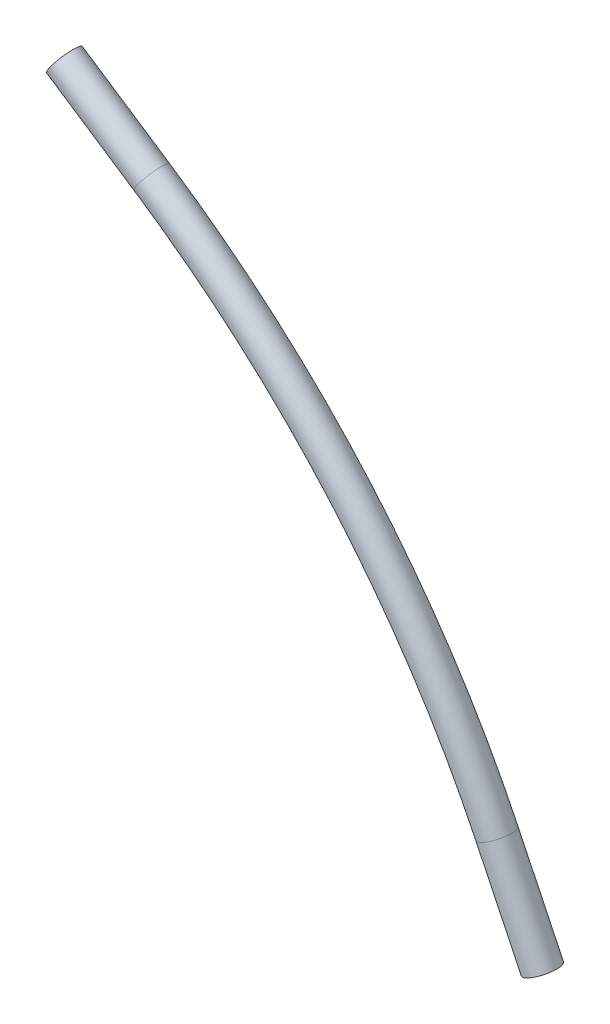
ISO-10303-21;
HEADER;
FILE_DESCRIPTION(('STEP AP214'),'2;1');
FILE_NAME('part.step','',(''),(''),'','','');
FILE_SCHEMA(('AUTOMOTIVE_DESIGN { 1 0 10303 214 1 1 1 1 }'));
ENDSEC;
DATA;
#1=APPLICATION_CONTEXT('core data for automotive mechanical design processes');
#2=APPLICATION_PROTOCOL_DEFINITION('international standard','automotive_design',2000,#1);
#3=PRODUCT_CONTEXT('',#1,'mechanical');
#4=PRODUCT('Part','Part','',(#3));
#5=PRODUCT_RELATED_PRODUCT_CATEGORY('part','',(#4));
#6=PRODUCT_DEFINITION_FORMATION('','',#4);
#7=PRODUCT_DEFINITION_CONTEXT('part definition',#1,'design');
#8=PRODUCT_DEFINITION('design','',#6,#7);
#9=PRODUCT_DEFINITION_SHAPE('','',#8);
#10=(LENGTH_UNIT() NAMED_UNIT(*) SI_UNIT(.MILLI.,.METRE.));
#11=(NAMED_UNIT(*) PLANE_ANGLE_UNIT() SI_UNIT($,.RADIAN.));
#12=(NAMED_UNIT(*) SI_UNIT($,.STERADIAN.) SOLID_ANGLE_UNIT());
#13=UNCERTAINTY_MEASURE_WITH_UNIT(LENGTH_MEASURE(1.E-05),#10,'distance_accuracy_value','');
#14=(GEOMETRIC_REPRESENTATION_CONTEXT(3) GLOBAL_UNCERTAINTY_ASSIGNED_CONTEXT((#13)) GLOBAL_UNIT_ASSIGNED_CONTEXT((#10,
#11,#12)) REPRESENTATION_CONTEXT('',''));
#15=CARTESIAN_POINT('',(0.,0.,0.));
#16=DIRECTION('',(0.,0.,1.));
#17=DIRECTION('',(1.,0.,0.));
#18=AXIS2_PLACEMENT_3D('',#15,#16,#17);
#19=CARTESIAN_POINT('',(45.6269356465842,141.339048086015,0.));
#20=DIRECTION('',(-0.433534068813756,0.901137176670561,0.));
#21=DIRECTION('',(-0.901137176670561,-0.433534068813756,0.));
#22=AXIS2_PLACEMENT_3D('',#19,#20,#21);
#23=PLANE('',#22);
#24=CARTESIAN_POINT('',(45.6269356465842,141.339048086015,0.));
#25=DIRECTION('',(-0.433534068813756,0.901137176670561,0.));
#26=DIRECTION('',(-0.901137176670561,-0.433534068813756,0.));
#27=AXIS2_PLACEMENT_3D('',#24,#25,#26);
#28=CIRCLE('',#27,3.);
#29=CARTESIAN_POINT('',(42.9235241165725,140.038445879574,0.));
#30=VERTEX_POINT('',#29);
#31=EDGE_CURVE('E69',#30,#30,#28,.T.);
#32=ORIENTED_EDGE('',*,*,#31,.F.);
#33=EDGE_LOOP('',(#32));
#34=FACE_BOUND('',#33,.T.);
#35=ADVANCED_FACE('F57',(#34),#23,.F.);
#36=CARTESIAN_POINT('',(-45.4103647478319,245.805534332556,0.));
#37=DIRECTION('',(-0.833394025952981,0.552679289919463,0.));
#38=DIRECTION('',(-0.552679289919463,-0.833394025952981,0.));
#39=AXIS2_PLACEMENT_3D('',#36,#37,#38);
#40=PLANE('',#39);
#41=CARTESIAN_POINT('',(-45.4103647478319,245.805534332556,0.));
#42=DIRECTION('',(-0.833394025952981,0.552679289919463,0.));
#43=DIRECTION('',(-0.552679289919463,-0.833394025952981,0.));
#44=AXIS2_PLACEMENT_3D('',#41,#42,#43);
#45=CIRCLE('',#44,3.);
#46=CARTESIAN_POINT('',(-47.0684026175903,243.305352254697,0.));
#47=VERTEX_POINT('',#46);
#48=EDGE_CURVE('E14',#47,#47,#45,.T.);
#49=ORIENTED_EDGE('',*,*,#48,.T.);
#50=EDGE_LOOP('',(#49));
#51=FACE_BOUND('',#50,.T.);
#52=ADVANCED_FACE('F72',(#51),#40,.T.);
#53=CARTESIAN_POINT('',(45.6269356465842,141.339048086015,0.));
#54=DIRECTION('',(-0.433534068813755,0.901137176670561,0.));
#55=DIRECTION('',(-0.901137176670561,-0.433534068813755,0.));
#56=AXIS2_PLACEMENT_3D('',#53,#54,#55);
#57=CYLINDRICAL_SURFACE('',#56,3.);
#58=CARTESIAN_POINT('',(36.9562542703091,159.361791619426,0.));
#59=DIRECTION('',(-0.433534068813756,0.901137176670561,0.));
#60=DIRECTION('',(-0.901137176670561,-0.433534068813756,0.));
#61=AXIS2_PLACEMENT_3D('',#58,#59,#60);
#62=CIRCLE('',#61,3.);
#63=CARTESIAN_POINT('',(39.6596658003207,160.662393825868,0.));
#64=VERTEX_POINT('',#63);
#65=EDGE_CURVE('E82',#64,#64,#62,.T.);
#66=ORIENTED_EDGE('',*,*,#65,.F.);
#67=EDGE_LOOP('',(#66));
#68=FACE_BOUND('',#67,.T.);
#69=ORIENTED_EDGE('',*,*,#31,.T.);
#70=EDGE_LOOP('',(#69));
#71=FACE_BOUND('',#70,.T.);
#72=ADVANCED_FACE('F87',(#68,#71),#57,.T.);
#73=CARTESIAN_POINT('',(-132.945412395567,77.6226704791349,0.));
#74=DIRECTION('',(0.,0.,1.));
#75=DIRECTION('',(1.,0.,0.));
#76=AXIS2_PLACEMENT_3D('',#73,#74,#75);
#77=TOROIDAL_SURFACE('',#76,188.541401980121,3.);
#78=CARTESIAN_POINT('',(-28.7424842287711,234.751948534166,0.));
#79=DIRECTION('',(-0.833394025952974,0.552679289919474,0.));
#80=DIRECTION('',(-0.552679289919474,-0.833394025952974,0.));
#81=AXIS2_PLACEMENT_3D('',#78,#79,#80);
#82=CIRCLE('',#81,3.);
#83=CARTESIAN_POINT('',(-27.0844463590127,237.252130612025,0.));
#84=VERTEX_POINT('',#83);
#85=EDGE_CURVE('E64',#84,#84,#82,.T.);
#86=CARTESIAN_POINT('',(-132.945412395567,77.6226704791349,0.));
#87=DIRECTION('',(0.,0.,1.));
#88=DIRECTION('',(1.,0.,0.));
#89=AXIS2_PLACEMENT_3D('',#86,#87,#88);
#90=CIRCLE('',#89,191.541401980121);
#91=EDGE_CURVE('',#64,#84,#90,.T.);
#92=ORIENTED_EDGE('',*,*,#65,.T.);
#93=ORIENTED_EDGE('',*,*,#85,.F.);
#94=ORIENTED_EDGE('',*,*,#91,.T.);
#95=ORIENTED_EDGE('',*,*,#91,.F.);
#96=EDGE_LOOP('',(#92,#94,#93,#95));
#97=FACE_BOUND('',#96,.T.);
#98=ADVANCED_FACE('F77',(#97),#77,.T.);
#99=CARTESIAN_POINT('',(-28.7424842287711,234.751948534166,0.));
#100=DIRECTION('',(-0.83339402595298,0.552679289919465,0.));
#101=DIRECTION('',(-0.552679289919465,-0.83339402595298,0.));
#102=AXIS2_PLACEMENT_3D('',#99,#100,#101);
#103=CYLINDRICAL_SURFACE('',#102,3.);
#104=ORIENTED_EDGE('',*,*,#48,.F.);
#105=EDGE_LOOP('',(#104));
#106=FACE_BOUND('',#105,.T.);
#107=ORIENTED_EDGE('',*,*,#85,.T.);
#108=EDGE_LOOP('',(#107));
#109=FACE_BOUND('',#108,.T.);
#110=ADVANCED_FACE('F74',(#106,#109),#103,.T.);
#111=CLOSED_SHELL('',(#35,#52,#72,#98,#110));
#112=MANIFOLD_SOLID_BREP('B2',#111);
#113=ADVANCED_BREP_SHAPE_REPRESENTATION('',(#18,#112),#14);
#114=SHAPE_DEFINITION_REPRESENTATION(#9,#113);
ENDSEC;
END-ISO-10303-21;
